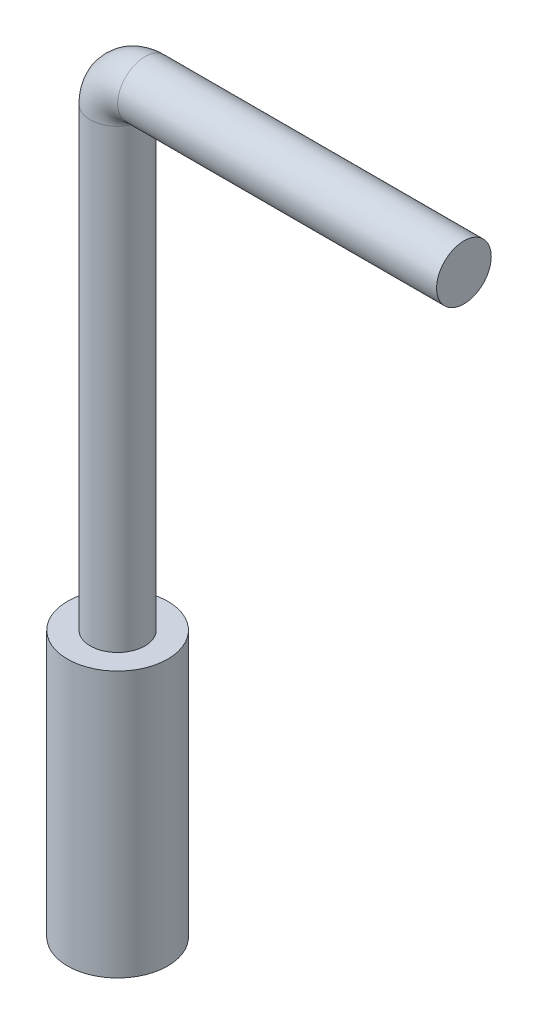
ISO-10303-21;
HEADER;
FILE_DESCRIPTION(('STEP AP214'),'2;1');
FILE_NAME('part.step','',(''),(''),'','','');
FILE_SCHEMA(('AUTOMOTIVE_DESIGN { 1 0 10303 214 1 1 1 1 }'));
ENDSEC;
DATA;
#1=APPLICATION_CONTEXT('core data for automotive mechanical design processes');
#2=APPLICATION_PROTOCOL_DEFINITION('international standard','automotive_design',2000,#1);
#3=PRODUCT_CONTEXT('',#1,'mechanical');
#4=PRODUCT('Part','Part','',(#3));
#5=PRODUCT_RELATED_PRODUCT_CATEGORY('part','',(#4));
#6=PRODUCT_DEFINITION_FORMATION('','',#4);
#7=PRODUCT_DEFINITION_CONTEXT('part definition',#1,'design');
#8=PRODUCT_DEFINITION('design','',#6,#7);
#9=PRODUCT_DEFINITION_SHAPE('','',#8);
#10=(LENGTH_UNIT() NAMED_UNIT(*) SI_UNIT(.MILLI.,.METRE.));
#11=(NAMED_UNIT(*) PLANE_ANGLE_UNIT() SI_UNIT($,.RADIAN.));
#12=(NAMED_UNIT(*) SI_UNIT($,.STERADIAN.) SOLID_ANGLE_UNIT());
#13=UNCERTAINTY_MEASURE_WITH_UNIT(LENGTH_MEASURE(1.E-05),#10,'distance_accuracy_value','');
#14=(GEOMETRIC_REPRESENTATION_CONTEXT(3) GLOBAL_UNCERTAINTY_ASSIGNED_CONTEXT((#13)) GLOBAL_UNIT_ASSIGNED_CONTEXT((#10,
#11,#12)) REPRESENTATION_CONTEXT('',''));
#15=CARTESIAN_POINT('',(0.,0.,0.));
#16=DIRECTION('',(0.,0.,1.));
#17=DIRECTION('',(1.,0.,0.));
#18=AXIS2_PLACEMENT_3D('',#15,#16,#17);
#19=CARTESIAN_POINT('',(22.8,72.6999994553702,-3.44999999999996));
#20=DIRECTION('',(1.,0.,0.));
#21=DIRECTION('',(0.,0.,-1.));
#22=AXIS2_PLACEMENT_3D('',#19,#20,#21);
#23=PLANE('',#22);
#24=CARTESIAN_POINT('',(22.8,72.6999994553701,-3.44999999999996));
#25=DIRECTION('',(1.,0.,0.));
#26=DIRECTION('',(0.,0.,-1.));
#27=AXIS2_PLACEMENT_3D('',#24,#25,#26);
#28=CIRCLE('',#27,1.8);
#29=CARTESIAN_POINT('',(22.8,72.6999994553701,-5.24999999999996));
#30=VERTEX_POINT('',#29);
#31=EDGE_CURVE('E20',#30,#30,#28,.F.);
#32=ORIENTED_EDGE('',*,*,#31,.F.);
#33=EDGE_LOOP('',(#32));
#34=FACE_BOUND('',#33,.T.);
#35=ADVANCED_FACE('F17',(#34),#23,.T.);
#36=CARTESIAN_POINT('',(1.8,72.6999994553701,-3.44999999999991));
#37=DIRECTION('',(1.,0.,0.));
#38=DIRECTION('',(0.,0.,-1.));
#39=AXIS2_PLACEMENT_3D('',#36,#37,#38);
#40=CYLINDRICAL_SURFACE('',#39,1.8);
#41=CARTESIAN_POINT('',(1.79999999999999,72.6999994553701,-3.44999999999991));
#42=DIRECTION('',(1.,0.,0.));
#43=DIRECTION('',(0.,0.,-1.));
#44=AXIS2_PLACEMENT_3D('',#41,#42,#43);
#45=CIRCLE('',#44,1.8);
#46=CARTESIAN_POINT('',(1.79999999999999,70.8999995915276,-3.44999999999998));
#47=VERTEX_POINT('',#46);
#48=EDGE_CURVE('E30',#47,#47,#45,.T.);
#49=ORIENTED_EDGE('',*,*,#48,.T.);
#50=EDGE_LOOP('',(#49));
#51=FACE_BOUND('',#50,.T.);
#52=ORIENTED_EDGE('',*,*,#31,.T.);
#53=EDGE_LOOP('',(#52));
#54=FACE_BOUND('',#53,.T.);
#55=ADVANCED_FACE('F95',(#51,#54),#40,.T.);
#56=CARTESIAN_POINT('',(1.8,70.8999994553701,-3.44999999999995));
#57=CARTESIAN_POINT('',(1.8,70.8999994553701,-3.44999999999995));
#58=CARTESIAN_POINT('',(1.8,70.8999994553701,-3.44999999999995));
#59=CARTESIAN_POINT('',(1.8,70.8999994553701,-1.64999999999995));
#60=CARTESIAN_POINT('',(1.8,70.8999994553701,-1.64999999999995));
#61=CARTESIAN_POINT('',(1.8,70.8999994553701,-1.64999999999995));
#62=CARTESIAN_POINT('',(0.,70.8999994553701,-1.64999999999995));
#63=CARTESIAN_POINT('',(0.,72.6999994553701,-1.64999999999995));
#64=CARTESIAN_POINT('',(1.8,72.6999994553701,-1.64999999999995));
#65=CARTESIAN_POINT('',(-1.80000000000001,70.8999994553701,-1.64999999999994));
#66=CARTESIAN_POINT('',(-1.80000000000001,74.4999994553702,-1.64999999999994));
#67=CARTESIAN_POINT('',(1.8,74.4999994553702,-1.64999999999995));
#68=CARTESIAN_POINT('',(-1.80000000000001,70.8999994553701,-3.44999999999994));
#69=CARTESIAN_POINT('',(-1.80000000000001,74.4999994553702,-3.44999999999994));
#70=CARTESIAN_POINT('',(1.8,74.4999994553702,-3.44999999999995));
#71=CARTESIAN_POINT('',(-1.80000000000002,70.8999994553701,-5.24999999999995));
#72=CARTESIAN_POINT('',(-1.80000000000002,74.4999994553702,-5.24999999999995));
#73=CARTESIAN_POINT('',(1.8,74.4999994553702,-5.24999999999995));
#74=CARTESIAN_POINT('',(0.,70.8999994553701,-5.24999999999995));
#75=CARTESIAN_POINT('',(0.,72.6999994553701,-5.24999999999995));
#76=CARTESIAN_POINT('',(1.8,72.6999994553701,-5.24999999999995));
#77=CARTESIAN_POINT('',(1.8,70.8999994553701,-5.24999999999995));
#78=CARTESIAN_POINT('',(1.8,70.8999994553701,-5.24999999999995));
#79=CARTESIAN_POINT('',(1.8,70.8999994553701,-5.24999999999995));
#80=CARTESIAN_POINT('',(1.8,70.8999994553701,-3.44999999999995));
#81=CARTESIAN_POINT('',(1.8,70.8999994553701,-3.44999999999995));
#82=CARTESIAN_POINT('',(1.8,70.8999994553701,-3.44999999999995));
#83=(BOUNDED_SURFACE() B_SPLINE_SURFACE(2,2,((#56,#57,#58),(#59,#60,#61),(#62,#63,#64),(#65,#66,
#67),(#68,#69,#70),(#71,#72,#73),(#74,#75,#76),(#77,#78,#79),(#80,#81,#82)),.UNSPECIFIED.,.T.,
.F.,.F.) B_SPLINE_SURFACE_WITH_KNOTS((3,2,2,2,3),(3,3),(-3.14159265358979,-1.5707963267949,0.,
1.5707963267949,3.14159265358979),(1.5707963267949,3.14159265358979),
.UNSPECIFIED.) GEOMETRIC_REPRESENTATION_ITEM() RATIONAL_B_SPLINE_SURFACE(((1.,0.707106781186547,
1.),(0.707106781186543,0.499999999999996,0.707106781186543),(1.,0.707106781186547,1.),
(0.707106781186543,0.499999999999996,0.707106781186543),(1.,0.707106781186547,1.),
(0.707106781186542,0.499999999999996,0.707106781186542),(1.,0.707106781186547,1.),
(0.707106781186542,0.499999999999996,0.707106781186542),(1.,0.707106781186547,1.))) REPRESENTATION_ITEM('') SURFACE());
#84=CARTESIAN_POINT('',(0.,70.8999994553701,-3.45));
#85=DIRECTION('',(0.,-1.,0.));
#86=DIRECTION('',(1.,0.,0.));
#87=AXIS2_PLACEMENT_3D('',#84,#85,#86);
#88=CIRCLE('',#87,1.8);
#89=EDGE_CURVE('E33',#47,#47,#88,.T.);
#90=ORIENTED_EDGE('',*,*,#89,.F.);
#91=ORIENTED_EDGE('',*,*,#48,.F.);
#92=EDGE_LOOP('',(#90,#91));
#93=FACE_BOUND('',#92,.T.);
#94=ADVANCED_FACE('F32',(#93),#83,.F.);
#95=CARTESIAN_POINT('',(0.,55.9,-3.45));
#96=DIRECTION('',(0.,-1.,0.));
#97=DIRECTION('',(1.,0.,0.));
#98=AXIS2_PLACEMENT_3D('',#95,#96,#97);
#99=CYLINDRICAL_SURFACE('',#98,1.8);
#100=ORIENTED_EDGE('',*,*,#89,.T.);
#101=EDGE_LOOP('',(#100));
#102=FACE_BOUND('',#101,.T.);
#103=CARTESIAN_POINT('',(0.,40.9,-3.45));
#104=DIRECTION('',(0.,-1.,0.));
#105=DIRECTION('',(1.,0.,0.));
#106=AXIS2_PLACEMENT_3D('',#103,#104,#105);
#107=CIRCLE('',#106,1.8);
#108=CARTESIAN_POINT('',(1.79999999999999,40.9,-3.45));
#109=VERTEX_POINT('',#108);
#110=EDGE_CURVE('E38',#109,#109,#107,.T.);
#111=ORIENTED_EDGE('',*,*,#110,.F.);
#112=EDGE_LOOP('',(#111));
#113=FACE_BOUND('',#112,.T.);
#114=ADVANCED_FACE('F36',(#102,#113),#99,.T.);
#115=CARTESIAN_POINT('',(0.,23.4000003814697,-6.90000000000001));
#116=DIRECTION('',(0.,1.,0.));
#117=DIRECTION('',(-1.,0.,0.));
#118=AXIS2_PLACEMENT_3D('',#115,#116,#117);
#119=PLANE('',#118);
#120=CARTESIAN_POINT('',(0.,23.4000003814697,-3.45));
#121=DIRECTION('',(0.,-1.,0.));
#122=DIRECTION('',(1.,0.,0.));
#123=AXIS2_PLACEMENT_3D('',#120,#121,#122);
#124=CIRCLE('',#123,3.3);
#125=CARTESIAN_POINT('',(3.3,23.4000003814697,-3.45));
#126=VERTEX_POINT('',#125);
#127=EDGE_CURVE('E24',#126,#126,#124,.F.);
#128=ORIENTED_EDGE('',*,*,#127,.F.);
#129=EDGE_LOOP('',(#128));
#130=FACE_BOUND('',#129,.T.);
#131=ADVANCED_FACE('F48',(#130),#119,.F.);
#132=CARTESIAN_POINT('',(0.,40.9,-3.45));
#133=DIRECTION('',(0.,1.,0.));
#134=DIRECTION('',(-1.,0.,0.));
#135=AXIS2_PLACEMENT_3D('',#132,#133,#134);
#136=PLANE('',#135);
#137=ORIENTED_EDGE('',*,*,#110,.T.);
#138=EDGE_LOOP('',(#137));
#139=FACE_BOUND('',#138,.T.);
#140=CARTESIAN_POINT('',(0.,40.9,-3.45));
#141=DIRECTION('',(0.,-1.,0.));
#142=DIRECTION('',(1.,0.,0.));
#143=AXIS2_PLACEMENT_3D('',#140,#141,#142);
#144=CIRCLE('',#143,3.3);
#145=CARTESIAN_POINT('',(3.29999999999999,40.9,-3.45));
#146=VERTEX_POINT('',#145);
#147=EDGE_CURVE('E11',#146,#146,#144,.T.);
#148=ORIENTED_EDGE('',*,*,#147,.F.);
#149=EDGE_LOOP('',(#148));
#150=FACE_BOUND('',#149,.T.);
#151=ADVANCED_FACE('F50',(#139,#150),#136,.T.);
#152=CARTESIAN_POINT('',(0.,40.9,-3.45));
#153=DIRECTION('',(0.,-1.,0.));
#154=DIRECTION('',(1.,0.,0.));
#155=AXIS2_PLACEMENT_3D('',#152,#153,#154);
#156=CYLINDRICAL_SURFACE('',#155,3.3);
#157=ORIENTED_EDGE('',*,*,#147,.T.);
#158=EDGE_LOOP('',(#157));
#159=FACE_BOUND('',#158,.T.);
#160=ORIENTED_EDGE('',*,*,#127,.T.);
#161=EDGE_LOOP('',(#160));
#162=FACE_BOUND('',#161,.T.);
#163=ADVANCED_FACE('F46',(#159,#162),#156,.T.);
#164=CLOSED_SHELL('',(#35,#55,#94,#114,#131,#151,#163));
#165=MANIFOLD_SOLID_BREP('B1',#164);
#166=ADVANCED_BREP_SHAPE_REPRESENTATION('',(#18,#165),#14);
#167=SHAPE_DEFINITION_REPRESENTATION(#9,#166);
ENDSEC;
END-ISO-10303-21;
